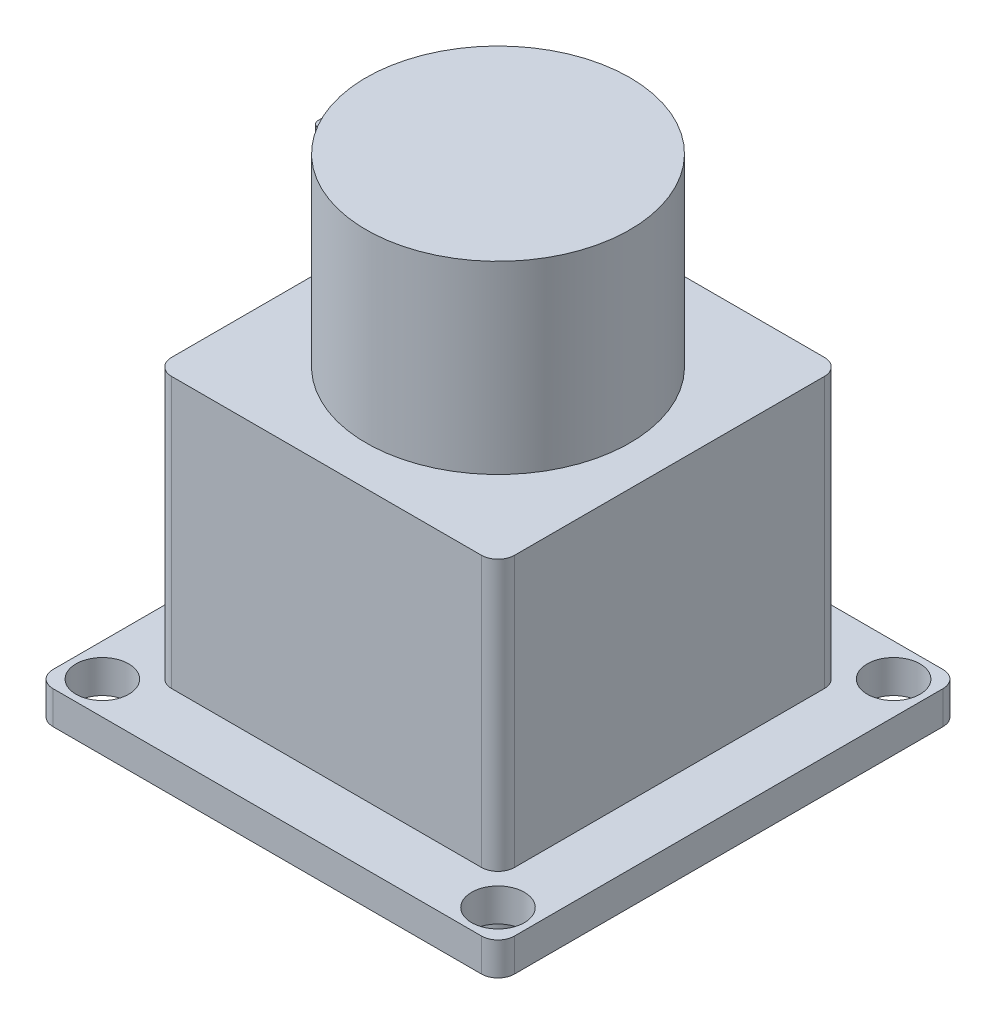
ISO-10303-21;
HEADER;
FILE_DESCRIPTION(('STEP AP214'),'2;1');
FILE_NAME('part.step','',(''),(''),'','','');
FILE_SCHEMA(('AUTOMOTIVE_DESIGN { 1 0 10303 214 1 1 1 1 }'));
ENDSEC;
DATA;
#1=APPLICATION_CONTEXT('core data for automotive mechanical design processes');
#2=APPLICATION_PROTOCOL_DEFINITION('international standard','automotive_design',2000,#1);
#3=PRODUCT_CONTEXT('',#1,'mechanical');
#4=PRODUCT('Part','Part','',(#3));
#5=PRODUCT_RELATED_PRODUCT_CATEGORY('part','',(#4));
#6=PRODUCT_DEFINITION_FORMATION('','',#4);
#7=PRODUCT_DEFINITION_CONTEXT('part definition',#1,'design');
#8=PRODUCT_DEFINITION('design','',#6,#7);
#9=PRODUCT_DEFINITION_SHAPE('','',#8);
#10=(LENGTH_UNIT() NAMED_UNIT(*) SI_UNIT(.MILLI.,.METRE.));
#11=(NAMED_UNIT(*) PLANE_ANGLE_UNIT() SI_UNIT($,.RADIAN.));
#12=(NAMED_UNIT(*) SI_UNIT($,.STERADIAN.) SOLID_ANGLE_UNIT());
#13=UNCERTAINTY_MEASURE_WITH_UNIT(LENGTH_MEASURE(1.E-05),#10,'distance_accuracy_value','');
#14=(GEOMETRIC_REPRESENTATION_CONTEXT(3) GLOBAL_UNCERTAINTY_ASSIGNED_CONTEXT((#13)) GLOBAL_UNIT_ASSIGNED_CONTEXT((#10,
#11,#12)) REPRESENTATION_CONTEXT('',''));
#15=CARTESIAN_POINT('',(0.,0.,0.));
#16=DIRECTION('',(0.,0.,1.));
#17=DIRECTION('',(1.,0.,0.));
#18=AXIS2_PLACEMENT_3D('',#15,#16,#17);
#19=CARTESIAN_POINT('',(0.,74.,0.));
#20=DIRECTION('',(0.,1.,0.));
#21=DIRECTION('',(0.,0.,1.));
#22=AXIS2_PLACEMENT_3D('',#19,#20,#21);
#23=PLANE('',#22);
#24=CARTESIAN_POINT('',(-1.07552855510562E-13,74.,0.));
#25=DIRECTION('',(0.,-1.,0.));
#26=DIRECTION('',(0.,0.,-1.));
#27=AXIS2_PLACEMENT_3D('',#24,#25,#26);
#28=CIRCLE('',#27,20.);
#29=CARTESIAN_POINT('',(-1.07552855510562E-13,74.,-20.));
#30=VERTEX_POINT('',#29);
#31=EDGE_CURVE('E20',#30,#30,#28,.T.);
#32=ORIENTED_EDGE('',*,*,#31,.F.);
#33=EDGE_LOOP('',(#32));
#34=FACE_BOUND('',#33,.T.);
#35=ADVANCED_FACE('F17',(#34),#23,.T.);
#36=CARTESIAN_POINT('',(-22.9365172470036,66.,-2.25));
#37=DIRECTION('',(0.,0.,-1.));
#38=DIRECTION('',(-1.,0.,0.));
#39=AXIS2_PLACEMENT_3D('',#36,#37,#38);
#40=PLANE('',#39);
#41=DIRECTION('',(1.,0.,0.));
#42=VECTOR('',#41,1.);
#43=CARTESIAN_POINT('',(0.,66.,-2.25));
#44=LINE('',#43,#42);
#45=CARTESIAN_POINT('',(-19.8730344940073,66.,-2.25));
#46=VERTEX_POINT('',#45);
#47=CARTESIAN_POINT('',(-25.,66.,-2.25));
#48=VERTEX_POINT('',#47);
#49=EDGE_CURVE('E183',#46,#48,#44,.F.);
#50=ORIENTED_EDGE('',*,*,#49,.F.);
#51=DIRECTION('',(0.,-1.,0.));
#52=VECTOR('',#51,1.);
#53=CARTESIAN_POINT('',(-19.8730344940073,74.,-2.24999999999999));
#54=LINE('',#53,#52);
#55=CARTESIAN_POINT('',(-19.8730344940073,46.,-2.25));
#56=VERTEX_POINT('',#55);
#57=EDGE_CURVE('E169',#56,#46,#54,.F.);
#58=ORIENTED_EDGE('',*,*,#57,.F.);
#59=DIRECTION('',(1.,0.,0.));
#60=VECTOR('',#59,1.);
#61=CARTESIAN_POINT('',(0.,46.,-2.25));
#62=LINE('',#61,#60);
#63=CARTESIAN_POINT('',(-25.,46.,-2.25));
#64=VERTEX_POINT('',#63);
#65=EDGE_CURVE('E311',#64,#56,#62,.T.);
#66=ORIENTED_EDGE('',*,*,#65,.F.);
#67=DIRECTION('',(0.,-1.,0.));
#68=VECTOR('',#67,1.);
#69=CARTESIAN_POINT('',(-25.,46.,-2.25));
#70=LINE('',#69,#68);
#71=EDGE_CURVE('E190',#48,#64,#70,.T.);
#72=ORIENTED_EDGE('',*,*,#71,.F.);
#73=EDGE_LOOP('',(#50,#58,#66,#72));
#74=FACE_BOUND('',#73,.T.);
#75=ADVANCED_FACE('F189',(#74),#40,.T.);
#76=CARTESIAN_POINT('',(-1.07552855510562E-13,74.,0.));
#77=DIRECTION('',(0.,-1.,0.));
#78=DIRECTION('',(0.,0.,-1.));
#79=AXIS2_PLACEMENT_3D('',#76,#77,#78);
#80=CYLINDRICAL_SURFACE('',#79,20.);
#81=CARTESIAN_POINT('',(-1.07552855510562E-13,46.,0.));
#82=DIRECTION('',(0.,-1.,0.));
#83=DIRECTION('',(0.,0.,-1.));
#84=AXIS2_PLACEMENT_3D('',#81,#82,#83);
#85=CIRCLE('',#84,20.);
#86=CARTESIAN_POINT('',(-19.8730344940073,46.,2.25));
#87=VERTEX_POINT('',#86);
#88=EDGE_CURVE('E174',#56,#87,#85,.T.);
#89=ORIENTED_EDGE('',*,*,#88,.F.);
#90=ORIENTED_EDGE('',*,*,#57,.T.);
#91=CARTESIAN_POINT('',(-1.07552855510562E-13,66.,0.));
#92=DIRECTION('',(0.,-1.,0.));
#93=DIRECTION('',(0.,0.,-1.));
#94=AXIS2_PLACEMENT_3D('',#91,#92,#93);
#95=CIRCLE('',#94,20.);
#96=CARTESIAN_POINT('',(-19.8730344940073,66.,2.25));
#97=VERTEX_POINT('',#96);
#98=EDGE_CURVE('E173',#97,#46,#95,.T.);
#99=ORIENTED_EDGE('',*,*,#98,.F.);
#100=DIRECTION('',(0.,1.,0.));
#101=VECTOR('',#100,1.);
#102=CARTESIAN_POINT('',(-19.8730344940073,66.,2.25));
#103=LINE('',#102,#101);
#104=EDGE_CURVE('E163',#97,#87,#103,.F.);
#105=ORIENTED_EDGE('',*,*,#104,.T.);
#106=EDGE_LOOP('',(#89,#90,#99,#105));
#107=FACE_BOUND('',#106,.T.);
#108=ORIENTED_EDGE('',*,*,#31,.T.);
#109=EDGE_LOOP('',(#108));
#110=FACE_BOUND('',#109,.T.);
#111=ADVANCED_FACE('F171',(#107,#110),#80,.T.);
#112=CARTESIAN_POINT('',(-22.9365172470036,66.,2.25));
#113=DIRECTION('',(0.,0.,-1.));
#114=DIRECTION('',(-1.,0.,0.));
#115=AXIS2_PLACEMENT_3D('',#112,#113,#114);
#116=PLANE('',#115);
#117=DIRECTION('',(0.,1.,0.));
#118=VECTOR('',#117,1.);
#119=CARTESIAN_POINT('',(-25.,66.,2.25));
#120=LINE('',#119,#118);
#121=CARTESIAN_POINT('',(-25.,46.,2.25));
#122=VERTEX_POINT('',#121);
#123=CARTESIAN_POINT('',(-25.,66.,2.25));
#124=VERTEX_POINT('',#123);
#125=EDGE_CURVE('E196',#122,#124,#120,.T.);
#126=ORIENTED_EDGE('',*,*,#125,.F.);
#127=DIRECTION('',(1.,0.,0.));
#128=VECTOR('',#127,1.);
#129=CARTESIAN_POINT('',(0.,46.,2.25));
#130=LINE('',#129,#128);
#131=EDGE_CURVE('E309',#87,#122,#130,.F.);
#132=ORIENTED_EDGE('',*,*,#131,.F.);
#133=ORIENTED_EDGE('',*,*,#104,.F.);
#134=DIRECTION('',(1.,0.,0.));
#135=VECTOR('',#134,1.);
#136=CARTESIAN_POINT('',(0.,66.,2.25));
#137=LINE('',#136,#135);
#138=EDGE_CURVE('E186',#124,#97,#137,.T.);
#139=ORIENTED_EDGE('',*,*,#138,.F.);
#140=EDGE_LOOP('',(#126,#132,#133,#139));
#141=FACE_BOUND('',#140,.T.);
#142=ADVANCED_FACE('F547',(#141),#116,.F.);
#143=CARTESIAN_POINT('',(0.,66.,0.));
#144=DIRECTION('',(0.,1.,0.));
#145=DIRECTION('',(0.,0.,1.));
#146=AXIS2_PLACEMENT_3D('',#143,#144,#145);
#147=PLANE('',#146);
#148=ORIENTED_EDGE('',*,*,#138,.T.);
#149=ORIENTED_EDGE('',*,*,#98,.T.);
#150=ORIENTED_EDGE('',*,*,#49,.T.);
#151=CARTESIAN_POINT('',(-25.,66.,-1.25));
#152=DIRECTION('',(0.,-1.,0.));
#153=DIRECTION('',(0.,0.,-1.));
#154=AXIS2_PLACEMENT_3D('',#151,#152,#153);
#155=CIRCLE('',#154,1.);
#156=CARTESIAN_POINT('',(-26.,66.,-1.25));
#157=VERTEX_POINT('',#156);
#158=EDGE_CURVE('E187',#157,#48,#155,.T.);
#159=ORIENTED_EDGE('',*,*,#158,.F.);
#160=DIRECTION('',(0.,0.,1.));
#161=VECTOR('',#160,1.);
#162=CARTESIAN_POINT('',(-26.,66.,0.));
#163=LINE('',#162,#161);
#164=CARTESIAN_POINT('',(-26.,66.,1.25));
#165=VERTEX_POINT('',#164);
#166=EDGE_CURVE('E321',#165,#157,#163,.F.);
#167=ORIENTED_EDGE('',*,*,#166,.F.);
#168=CARTESIAN_POINT('',(-25.,66.,1.25));
#169=DIRECTION('',(0.,1.,0.));
#170=DIRECTION('',(0.,0.,1.));
#171=AXIS2_PLACEMENT_3D('',#168,#169,#170);
#172=CIRCLE('',#171,1.);
#173=EDGE_CURVE('E199',#124,#165,#172,.F.);
#174=ORIENTED_EDGE('',*,*,#173,.F.);
#175=EDGE_LOOP('',(#148,#149,#150,#159,#167,#174));
#176=FACE_BOUND('',#175,.T.);
#177=ADVANCED_FACE('F181',(#176),#147,.T.);
#178=CARTESIAN_POINT('',(-25.,46.,-1.25));
#179=DIRECTION('',(0.,-1.,0.));
#180=DIRECTION('',(0.,0.,-1.));
#181=AXIS2_PLACEMENT_3D('',#178,#179,#180);
#182=CYLINDRICAL_SURFACE('',#181,1.);
#183=CARTESIAN_POINT('',(-25.,46.,-1.25));
#184=DIRECTION('',(0.,-1.,0.));
#185=DIRECTION('',(0.,0.,-1.));
#186=AXIS2_PLACEMENT_3D('',#183,#184,#185);
#187=CIRCLE('',#186,1.);
#188=CARTESIAN_POINT('',(-26.,46.,-1.25));
#189=VERTEX_POINT('',#188);
#190=EDGE_CURVE('E198',#189,#64,#187,.T.);
#191=ORIENTED_EDGE('',*,*,#190,.F.);
#192=DIRECTION('',(0.,1.,0.));
#193=VECTOR('',#192,1.);
#194=CARTESIAN_POINT('',(-26.,46.,-1.25));
#195=LINE('',#194,#193);
#196=EDGE_CURVE('E319',#157,#189,#195,.F.);
#197=ORIENTED_EDGE('',*,*,#196,.F.);
#198=ORIENTED_EDGE('',*,*,#158,.T.);
#199=ORIENTED_EDGE('',*,*,#71,.T.);
#200=EDGE_LOOP('',(#191,#197,#198,#199));
#201=FACE_BOUND('',#200,.T.);
#202=ADVANCED_FACE('F318',(#201),#182,.T.);
#203=CARTESIAN_POINT('',(-25.,66.,1.25));
#204=DIRECTION('',(0.,1.,0.));
#205=DIRECTION('',(0.,0.,1.));
#206=AXIS2_PLACEMENT_3D('',#203,#204,#205);
#207=CYLINDRICAL_SURFACE('',#206,1.);
#208=CARTESIAN_POINT('',(-25.,46.,1.25));
#209=DIRECTION('',(0.,1.,0.));
#210=DIRECTION('',(0.,0.,1.));
#211=AXIS2_PLACEMENT_3D('',#208,#209,#210);
#212=CIRCLE('',#211,1.);
#213=CARTESIAN_POINT('',(-26.,46.,1.25));
#214=VERTEX_POINT('',#213);
#215=EDGE_CURVE('E307',#122,#214,#212,.F.);
#216=ORIENTED_EDGE('',*,*,#215,.F.);
#217=ORIENTED_EDGE('',*,*,#125,.T.);
#218=ORIENTED_EDGE('',*,*,#173,.T.);
#219=DIRECTION('',(0.,1.,0.));
#220=VECTOR('',#219,1.);
#221=CARTESIAN_POINT('',(-26.,46.,1.25));
#222=LINE('',#221,#220);
#223=EDGE_CURVE('E302',#214,#165,#222,.T.);
#224=ORIENTED_EDGE('',*,*,#223,.F.);
#225=EDGE_LOOP('',(#216,#217,#218,#224));
#226=FACE_BOUND('',#225,.T.);
#227=ADVANCED_FACE('F538',(#226),#207,.T.);
#228=CARTESIAN_POINT('',(0.,46.,0.));
#229=DIRECTION('',(0.,1.,0.));
#230=DIRECTION('',(0.,0.,1.));
#231=AXIS2_PLACEMENT_3D('',#228,#229,#230);
#232=PLANE('',#231);
#233=DIRECTION('',(-1.,0.,0.));
#234=VECTOR('',#233,1.);
#235=CARTESIAN_POINT('',(0.,46.,-26.));
#236=LINE('',#235,#234);
#237=CARTESIAN_POINT('',(-23.5,46.,-26.));
#238=VERTEX_POINT('',#237);
#239=CARTESIAN_POINT('',(23.5,46.,-26.));
#240=VERTEX_POINT('',#239);
#241=EDGE_CURVE('E335',#238,#240,#236,.F.);
#242=ORIENTED_EDGE('',*,*,#241,.F.);
#243=CARTESIAN_POINT('',(-23.5,46.,-23.5));
#244=DIRECTION('',(0.,-1.,0.));
#245=DIRECTION('',(0.,0.,-1.));
#246=AXIS2_PLACEMENT_3D('',#243,#244,#245);
#247=CIRCLE('',#246,2.5);
#248=CARTESIAN_POINT('',(-26.,46.,-23.5));
#249=VERTEX_POINT('',#248);
#250=EDGE_CURVE('E299',#249,#238,#247,.T.);
#251=ORIENTED_EDGE('',*,*,#250,.F.);
#252=DIRECTION('',(0.,0.,1.));
#253=VECTOR('',#252,1.);
#254=CARTESIAN_POINT('',(-26.,46.,0.));
#255=LINE('',#254,#253);
#256=EDGE_CURVE('E324',#189,#249,#255,.F.);
#257=ORIENTED_EDGE('',*,*,#256,.F.);
#258=ORIENTED_EDGE('',*,*,#190,.T.);
#259=ORIENTED_EDGE('',*,*,#65,.T.);
#260=ORIENTED_EDGE('',*,*,#88,.T.);
#261=ORIENTED_EDGE('',*,*,#131,.T.);
#262=ORIENTED_EDGE('',*,*,#215,.T.);
#263=DIRECTION('',(0.,0.,1.));
#264=VECTOR('',#263,1.);
#265=CARTESIAN_POINT('',(-26.,46.,0.));
#266=LINE('',#265,#264);
#267=CARTESIAN_POINT('',(-26.,46.,23.5));
#268=VERTEX_POINT('',#267);
#269=EDGE_CURVE('E330',#268,#214,#266,.F.);
#270=ORIENTED_EDGE('',*,*,#269,.F.);
#271=CARTESIAN_POINT('',(-23.5,46.,23.5));
#272=DIRECTION('',(0.,1.,0.));
#273=DIRECTION('',(0.,0.,1.));
#274=AXIS2_PLACEMENT_3D('',#271,#272,#273);
#275=CIRCLE('',#274,2.5);
#276=CARTESIAN_POINT('',(-23.5,46.,26.));
#277=VERTEX_POINT('',#276);
#278=EDGE_CURVE('E303',#277,#268,#275,.F.);
#279=ORIENTED_EDGE('',*,*,#278,.F.);
#280=DIRECTION('',(-1.,0.,0.));
#281=VECTOR('',#280,1.);
#282=CARTESIAN_POINT('',(0.,46.,26.));
#283=LINE('',#282,#281);
#284=CARTESIAN_POINT('',(23.5,46.,26.));
#285=VERTEX_POINT('',#284);
#286=EDGE_CURVE('E306',#277,#285,#283,.F.);
#287=ORIENTED_EDGE('',*,*,#286,.T.);
#288=CARTESIAN_POINT('',(23.5,46.,23.5));
#289=DIRECTION('',(0.,-1.,0.));
#290=DIRECTION('',(0.,0.,-1.));
#291=AXIS2_PLACEMENT_3D('',#288,#289,#290);
#292=CIRCLE('',#291,2.5);
#293=CARTESIAN_POINT('',(26.,46.,23.5));
#294=VERTEX_POINT('',#293);
#295=EDGE_CURVE('E291',#294,#285,#292,.T.);
#296=ORIENTED_EDGE('',*,*,#295,.F.);
#297=DIRECTION('',(0.,0.,1.));
#298=VECTOR('',#297,1.);
#299=CARTESIAN_POINT('',(26.,46.,0.));
#300=LINE('',#299,#298);
#301=CARTESIAN_POINT('',(26.,46.,-23.5));
#302=VERTEX_POINT('',#301);
#303=EDGE_CURVE('E294',#294,#302,#300,.F.);
#304=ORIENTED_EDGE('',*,*,#303,.T.);
#305=CARTESIAN_POINT('',(23.5,46.,-23.5));
#306=DIRECTION('',(0.,1.,0.));
#307=DIRECTION('',(0.,0.,1.));
#308=AXIS2_PLACEMENT_3D('',#305,#306,#307);
#309=CIRCLE('',#308,2.5);
#310=EDGE_CURVE('E295',#240,#302,#309,.F.);
#311=ORIENTED_EDGE('',*,*,#310,.F.);
#312=EDGE_LOOP('',(#242,#251,#257,#258,#259,#260,#261,#262,#270,#279,#287,#296,#304,#311));
#313=FACE_BOUND('',#312,.T.);
#314=ADVANCED_FACE('F534',(#313),#232,.T.);
#315=CARTESIAN_POINT('',(0.,46.,26.));
#316=DIRECTION('',(0.,0.,-1.));
#317=DIRECTION('',(-1.,0.,0.));
#318=AXIS2_PLACEMENT_3D('',#315,#316,#317);
#319=PLANE('',#318);
#320=DIRECTION('',(0.,1.,0.));
#321=VECTOR('',#320,1.);
#322=CARTESIAN_POINT('',(-23.5,46.,26.));
#323=LINE('',#322,#321);
#324=CARTESIAN_POINT('',(-23.5,5.,26.));
#325=VERTEX_POINT('',#324);
#326=EDGE_CURVE('E305',#325,#277,#323,.T.);
#327=ORIENTED_EDGE('',*,*,#326,.F.);
#328=DIRECTION('',(1.,0.,0.));
#329=VECTOR('',#328,1.);
#330=CARTESIAN_POINT('',(0.,5.,26.));
#331=LINE('',#330,#329);
#332=CARTESIAN_POINT('',(23.5,5.,26.));
#333=VERTEX_POINT('',#332);
#334=EDGE_CURVE('E290',#333,#325,#331,.F.);
#335=ORIENTED_EDGE('',*,*,#334,.F.);
#336=DIRECTION('',(0.,-1.,0.));
#337=VECTOR('',#336,1.);
#338=CARTESIAN_POINT('',(23.5,46.,26.));
#339=LINE('',#338,#337);
#340=EDGE_CURVE('E293',#285,#333,#339,.T.);
#341=ORIENTED_EDGE('',*,*,#340,.F.);
#342=ORIENTED_EDGE('',*,*,#286,.F.);
#343=EDGE_LOOP('',(#327,#335,#341,#342));
#344=FACE_BOUND('',#343,.T.);
#345=ADVANCED_FACE('F530',(#344),#319,.F.);
#346=CARTESIAN_POINT('',(-23.5,46.,23.5));
#347=DIRECTION('',(0.,1.,0.));
#348=DIRECTION('',(0.,0.,1.));
#349=AXIS2_PLACEMENT_3D('',#346,#347,#348);
#350=CYLINDRICAL_SURFACE('',#349,2.5);
#351=CARTESIAN_POINT('',(-23.5,5.,23.5));
#352=DIRECTION('',(0.,1.,0.));
#353=DIRECTION('',(0.,0.,1.));
#354=AXIS2_PLACEMENT_3D('',#351,#352,#353);
#355=CIRCLE('',#354,2.5);
#356=CARTESIAN_POINT('',(-26.,5.,23.5));
#357=VERTEX_POINT('',#356);
#358=EDGE_CURVE('E288',#325,#357,#355,.F.);
#359=ORIENTED_EDGE('',*,*,#358,.F.);
#360=ORIENTED_EDGE('',*,*,#326,.T.);
#361=ORIENTED_EDGE('',*,*,#278,.T.);
#362=DIRECTION('',(0.,1.,0.));
#363=VECTOR('',#362,1.);
#364=CARTESIAN_POINT('',(-26.,46.,23.5));
#365=LINE('',#364,#363);
#366=EDGE_CURVE('E333',#357,#268,#365,.T.);
#367=ORIENTED_EDGE('',*,*,#366,.F.);
#368=EDGE_LOOP('',(#359,#360,#361,#367));
#369=FACE_BOUND('',#368,.T.);
#370=ADVANCED_FACE('F527',(#369),#350,.T.);
#371=CARTESIAN_POINT('',(-26.,46.,0.));
#372=DIRECTION('',(-1.,0.,0.));
#373=DIRECTION('',(0.,0.,1.));
#374=AXIS2_PLACEMENT_3D('',#371,#372,#373);
#375=PLANE('',#374);
#376=ORIENTED_EDGE('',*,*,#269,.T.);
#377=ORIENTED_EDGE('',*,*,#223,.T.);
#378=ORIENTED_EDGE('',*,*,#166,.T.);
#379=ORIENTED_EDGE('',*,*,#196,.T.);
#380=ORIENTED_EDGE('',*,*,#256,.T.);
#381=DIRECTION('',(0.,-1.,0.));
#382=VECTOR('',#381,1.);
#383=CARTESIAN_POINT('',(-26.,46.,-23.5));
#384=LINE('',#383,#382);
#385=CARTESIAN_POINT('',(-26.,5.,-23.5));
#386=VERTEX_POINT('',#385);
#387=EDGE_CURVE('E301',#386,#249,#384,.F.);
#388=ORIENTED_EDGE('',*,*,#387,.F.);
#389=DIRECTION('',(0.,0.,1.));
#390=VECTOR('',#389,1.);
#391=CARTESIAN_POINT('',(-26.,5.,0.));
#392=LINE('',#391,#390);
#393=EDGE_CURVE('E287',#357,#386,#392,.F.);
#394=ORIENTED_EDGE('',*,*,#393,.F.);
#395=ORIENTED_EDGE('',*,*,#366,.T.);
#396=EDGE_LOOP('',(#376,#377,#378,#379,#380,#388,#394,#395));
#397=FACE_BOUND('',#396,.T.);
#398=ADVANCED_FACE('F523',(#397),#375,.T.);
#399=CARTESIAN_POINT('',(-23.5,46.,-23.5));
#400=DIRECTION('',(0.,-1.,0.));
#401=DIRECTION('',(0.,0.,-1.));
#402=AXIS2_PLACEMENT_3D('',#399,#400,#401);
#403=CYLINDRICAL_SURFACE('',#402,2.5);
#404=CARTESIAN_POINT('',(-23.5,5.,-23.5));
#405=DIRECTION('',(0.,-1.,0.));
#406=DIRECTION('',(0.,0.,-1.));
#407=AXIS2_PLACEMENT_3D('',#404,#405,#406);
#408=CIRCLE('',#407,2.5);
#409=CARTESIAN_POINT('',(-23.5,5.,-26.));
#410=VERTEX_POINT('',#409);
#411=EDGE_CURVE('E285',#386,#410,#408,.T.);
#412=ORIENTED_EDGE('',*,*,#411,.F.);
#413=ORIENTED_EDGE('',*,*,#387,.T.);
#414=ORIENTED_EDGE('',*,*,#250,.T.);
#415=DIRECTION('',(0.,1.,0.));
#416=VECTOR('',#415,1.);
#417=CARTESIAN_POINT('',(-23.5,46.,-26.));
#418=LINE('',#417,#416);
#419=EDGE_CURVE('E298',#410,#238,#418,.T.);
#420=ORIENTED_EDGE('',*,*,#419,.F.);
#421=EDGE_LOOP('',(#412,#413,#414,#420));
#422=FACE_BOUND('',#421,.T.);
#423=ADVANCED_FACE('F519',(#422),#403,.T.);
#424=CARTESIAN_POINT('',(0.,46.,-26.));
#425=DIRECTION('',(0.,0.,-1.));
#426=DIRECTION('',(-1.,0.,0.));
#427=AXIS2_PLACEMENT_3D('',#424,#425,#426);
#428=PLANE('',#427);
#429=DIRECTION('',(1.,0.,0.));
#430=VECTOR('',#429,1.);
#431=CARTESIAN_POINT('',(0.,5.,-26.));
#432=LINE('',#431,#430);
#433=CARTESIAN_POINT('',(23.5,5.,-26.));
#434=VERTEX_POINT('',#433);
#435=EDGE_CURVE('E284',#410,#434,#432,.T.);
#436=ORIENTED_EDGE('',*,*,#435,.F.);
#437=ORIENTED_EDGE('',*,*,#419,.T.);
#438=ORIENTED_EDGE('',*,*,#241,.T.);
#439=DIRECTION('',(0.,1.,0.));
#440=VECTOR('',#439,1.);
#441=CARTESIAN_POINT('',(23.5,46.,-26.));
#442=LINE('',#441,#440);
#443=EDGE_CURVE('E297',#434,#240,#442,.T.);
#444=ORIENTED_EDGE('',*,*,#443,.F.);
#445=EDGE_LOOP('',(#436,#437,#438,#444));
#446=FACE_BOUND('',#445,.T.);
#447=ADVANCED_FACE('F515',(#446),#428,.T.);
#448=CARTESIAN_POINT('',(23.5,46.,-23.5));
#449=DIRECTION('',(0.,1.,0.));
#450=DIRECTION('',(0.,0.,1.));
#451=AXIS2_PLACEMENT_3D('',#448,#449,#450);
#452=CYLINDRICAL_SURFACE('',#451,2.5);
#453=CARTESIAN_POINT('',(23.5,5.,-23.5));
#454=DIRECTION('',(0.,1.,0.));
#455=DIRECTION('',(0.,0.,1.));
#456=AXIS2_PLACEMENT_3D('',#453,#454,#455);
#457=CIRCLE('',#456,2.5);
#458=CARTESIAN_POINT('',(26.,5.,-23.5));
#459=VERTEX_POINT('',#458);
#460=EDGE_CURVE('E282',#434,#459,#457,.F.);
#461=ORIENTED_EDGE('',*,*,#460,.F.);
#462=ORIENTED_EDGE('',*,*,#443,.T.);
#463=ORIENTED_EDGE('',*,*,#310,.T.);
#464=DIRECTION('',(0.,1.,0.));
#465=VECTOR('',#464,1.);
#466=CARTESIAN_POINT('',(26.,46.,-23.5));
#467=LINE('',#466,#465);
#468=EDGE_CURVE('E342',#302,#459,#467,.F.);
#469=ORIENTED_EDGE('',*,*,#468,.T.);
#470=EDGE_LOOP('',(#461,#462,#463,#469));
#471=FACE_BOUND('',#470,.T.);
#472=ADVANCED_FACE('F511',(#471),#452,.T.);
#473=CARTESIAN_POINT('',(26.,46.,0.));
#474=DIRECTION('',(-1.,0.,0.));
#475=DIRECTION('',(0.,0.,1.));
#476=AXIS2_PLACEMENT_3D('',#473,#474,#475);
#477=PLANE('',#476);
#478=DIRECTION('',(0.,-1.,0.));
#479=VECTOR('',#478,1.);
#480=CARTESIAN_POINT('',(26.,46.,23.5));
#481=LINE('',#480,#479);
#482=CARTESIAN_POINT('',(26.,5.,23.5));
#483=VERTEX_POINT('',#482);
#484=EDGE_CURVE('E354',#483,#294,#481,.F.);
#485=ORIENTED_EDGE('',*,*,#484,.F.);
#486=DIRECTION('',(0.,0.,1.));
#487=VECTOR('',#486,1.);
#488=CARTESIAN_POINT('',(26.,5.,0.));
#489=LINE('',#488,#487);
#490=EDGE_CURVE('E281',#459,#483,#489,.T.);
#491=ORIENTED_EDGE('',*,*,#490,.F.);
#492=ORIENTED_EDGE('',*,*,#468,.F.);
#493=ORIENTED_EDGE('',*,*,#303,.F.);
#494=EDGE_LOOP('',(#485,#491,#492,#493));
#495=FACE_BOUND('',#494,.T.);
#496=ADVANCED_FACE('F507',(#495),#477,.F.);
#497=CARTESIAN_POINT('',(23.5,46.,23.5));
#498=DIRECTION('',(0.,-1.,0.));
#499=DIRECTION('',(0.,0.,-1.));
#500=AXIS2_PLACEMENT_3D('',#497,#498,#499);
#501=CYLINDRICAL_SURFACE('',#500,2.5);
#502=CARTESIAN_POINT('',(23.5,5.,23.5));
#503=DIRECTION('',(0.,-1.,0.));
#504=DIRECTION('',(0.,0.,-1.));
#505=AXIS2_PLACEMENT_3D('',#502,#503,#504);
#506=CIRCLE('',#505,2.5);
#507=EDGE_CURVE('E278',#483,#333,#506,.T.);
#508=ORIENTED_EDGE('',*,*,#507,.F.);
#509=ORIENTED_EDGE('',*,*,#484,.T.);
#510=ORIENTED_EDGE('',*,*,#295,.T.);
#511=ORIENTED_EDGE('',*,*,#340,.T.);
#512=EDGE_LOOP('',(#508,#509,#510,#511));
#513=FACE_BOUND('',#512,.T.);
#514=ADVANCED_FACE('F503',(#513),#501,.T.);
#515=CARTESIAN_POINT('',(0.,-5.,0.));
#516=DIRECTION('',(0.,-1.,0.));
#517=DIRECTION('',(0.,0.,-1.));
#518=AXIS2_PLACEMENT_3D('',#515,#516,#517);
#519=PLANE('',#518);
#520=CARTESIAN_POINT('',(-21.,-5.,21.));
#521=DIRECTION('',(0.,1.,0.));
#522=DIRECTION('',(0.,0.,1.));
#523=AXIS2_PLACEMENT_3D('',#520,#521,#522);
#524=CIRCLE('',#523,4.);
#525=CARTESIAN_POINT('',(-21.,-5.,25.));
#526=VERTEX_POINT('',#525);
#527=EDGE_CURVE('E275',#526,#526,#524,.T.);
#528=ORIENTED_EDGE('',*,*,#527,.F.);
#529=EDGE_LOOP('',(#528));
#530=FACE_BOUND('',#529,.T.);
#531=ADVANCED_FACE('F499',(#530),#519,.T.);
#532=CARTESIAN_POINT('',(0.,-5.,0.));
#533=DIRECTION('',(0.,-1.,0.));
#534=DIRECTION('',(0.,0.,-1.));
#535=AXIS2_PLACEMENT_3D('',#532,#533,#534);
#536=PLANE('',#535);
#537=CARTESIAN_POINT('',(-21.,-5.,-21.));
#538=DIRECTION('',(0.,1.,0.));
#539=DIRECTION('',(0.,0.,1.));
#540=AXIS2_PLACEMENT_3D('',#537,#538,#539);
#541=CIRCLE('',#540,4.);
#542=CARTESIAN_POINT('',(-21.,-5.,-17.));
#543=VERTEX_POINT('',#542);
#544=EDGE_CURVE('E272',#543,#543,#541,.T.);
#545=ORIENTED_EDGE('',*,*,#544,.F.);
#546=EDGE_LOOP('',(#545));
#547=FACE_BOUND('',#546,.T.);
#548=ADVANCED_FACE('F495',(#547),#536,.T.);
#549=CARTESIAN_POINT('',(0.,-5.,0.));
#550=DIRECTION('',(0.,-1.,0.));
#551=DIRECTION('',(0.,0.,-1.));
#552=AXIS2_PLACEMENT_3D('',#549,#550,#551);
#553=PLANE('',#552);
#554=CARTESIAN_POINT('',(21.,-5.,-21.));
#555=DIRECTION('',(0.,1.,0.));
#556=DIRECTION('',(0.,0.,1.));
#557=AXIS2_PLACEMENT_3D('',#554,#555,#556);
#558=CIRCLE('',#557,4.);
#559=CARTESIAN_POINT('',(21.,-5.,-17.));
#560=VERTEX_POINT('',#559);
#561=EDGE_CURVE('E269',#560,#560,#558,.T.);
#562=ORIENTED_EDGE('',*,*,#561,.F.);
#563=EDGE_LOOP('',(#562));
#564=FACE_BOUND('',#563,.T.);
#565=ADVANCED_FACE('F491',(#564),#553,.T.);
#566=CARTESIAN_POINT('',(0.,-5.,0.));
#567=DIRECTION('',(0.,-1.,0.));
#568=DIRECTION('',(0.,0.,-1.));
#569=AXIS2_PLACEMENT_3D('',#566,#567,#568);
#570=PLANE('',#569);
#571=CARTESIAN_POINT('',(21.,-5.,21.));
#572=DIRECTION('',(0.,1.,0.));
#573=DIRECTION('',(0.,0.,1.));
#574=AXIS2_PLACEMENT_3D('',#571,#572,#573);
#575=CIRCLE('',#574,4.);
#576=CARTESIAN_POINT('',(21.,-5.,25.));
#577=VERTEX_POINT('',#576);
#578=EDGE_CURVE('E266',#577,#577,#575,.T.);
#579=ORIENTED_EDGE('',*,*,#578,.F.);
#580=EDGE_LOOP('',(#579));
#581=FACE_BOUND('',#580,.T.);
#582=ADVANCED_FACE('F428',(#581),#570,.T.);
#583=CARTESIAN_POINT('',(0.,5.,0.));
#584=DIRECTION('',(0.,1.,0.));
#585=DIRECTION('',(0.,0.,1.));
#586=AXIS2_PLACEMENT_3D('',#583,#584,#585);
#587=PLANE('',#586);
#588=ORIENTED_EDGE('',*,*,#490,.T.);
#589=ORIENTED_EDGE('',*,*,#507,.T.);
#590=ORIENTED_EDGE('',*,*,#334,.T.);
#591=ORIENTED_EDGE('',*,*,#358,.T.);
#592=ORIENTED_EDGE('',*,*,#393,.T.);
#593=ORIENTED_EDGE('',*,*,#411,.T.);
#594=ORIENTED_EDGE('',*,*,#435,.T.);
#595=ORIENTED_EDGE('',*,*,#460,.T.);
#596=EDGE_LOOP('',(#588,#589,#590,#591,#592,#593,#594,#595));
#597=FACE_BOUND('',#596,.T.);
#598=CARTESIAN_POINT('',(-30.,5.,30.));
#599=DIRECTION('',(0.,-1.,0.));
#600=DIRECTION('',(0.,0.,-1.));
#601=AXIS2_PLACEMENT_3D('',#598,#599,#600);
#602=CIRCLE('',#601,4.);
#603=CARTESIAN_POINT('',(-30.,5.,26.));
#604=VERTEX_POINT('',#603);
#605=EDGE_CURVE('E263',#604,#604,#602,.T.);
#606=ORIENTED_EDGE('',*,*,#605,.T.);
#607=EDGE_LOOP('',(#606));
#608=FACE_BOUND('',#607,.T.);
#609=CARTESIAN_POINT('',(30.,5.,30.));
#610=DIRECTION('',(0.,-1.,0.));
#611=DIRECTION('',(0.,0.,-1.));
#612=AXIS2_PLACEMENT_3D('',#609,#610,#611);
#613=CIRCLE('',#612,4.);
#614=CARTESIAN_POINT('',(30.,5.,26.));
#615=VERTEX_POINT('',#614);
#616=EDGE_CURVE('E260',#615,#615,#613,.T.);
#617=ORIENTED_EDGE('',*,*,#616,.T.);
#618=EDGE_LOOP('',(#617));
#619=FACE_BOUND('',#618,.T.);
#620=DIRECTION('',(-1.,0.,0.));
#621=VECTOR('',#620,1.);
#622=CARTESIAN_POINT('',(0.,5.,35.));
#623=LINE('',#622,#621);
#624=CARTESIAN_POINT('',(-32.5,5.,35.));
#625=VERTEX_POINT('',#624);
#626=CARTESIAN_POINT('',(32.5,5.,35.));
#627=VERTEX_POINT('',#626);
#628=EDGE_CURVE('E252',#625,#627,#623,.F.);
#629=ORIENTED_EDGE('',*,*,#628,.T.);
#630=CARTESIAN_POINT('',(32.5,5.,32.5));
#631=DIRECTION('',(0.,1.,0.));
#632=DIRECTION('',(0.,0.,1.));
#633=AXIS2_PLACEMENT_3D('',#630,#631,#632);
#634=CIRCLE('',#633,2.5);
#635=CARTESIAN_POINT('',(35.,5.,32.5));
#636=VERTEX_POINT('',#635);
#637=EDGE_CURVE('E249',#636,#627,#634,.F.);
#638=ORIENTED_EDGE('',*,*,#637,.F.);
#639=DIRECTION('',(0.,0.,-1.));
#640=VECTOR('',#639,1.);
#641=CARTESIAN_POINT('',(35.,5.,30.5));
#642=LINE('',#641,#640);
#643=CARTESIAN_POINT('',(35.,5.,-32.5));
#644=VERTEX_POINT('',#643);
#645=EDGE_CURVE('E363',#644,#636,#642,.F.);
#646=ORIENTED_EDGE('',*,*,#645,.F.);
#647=CARTESIAN_POINT('',(32.5,5.,-32.5));
#648=DIRECTION('',(0.,-1.,0.));
#649=DIRECTION('',(0.,0.,-1.));
#650=AXIS2_PLACEMENT_3D('',#647,#648,#649);
#651=CIRCLE('',#650,2.5);
#652=CARTESIAN_POINT('',(32.5,5.,-35.));
#653=VERTEX_POINT('',#652);
#654=EDGE_CURVE('E245',#653,#644,#651,.T.);
#655=ORIENTED_EDGE('',*,*,#654,.F.);
#656=DIRECTION('',(-1.,0.,0.));
#657=VECTOR('',#656,1.);
#658=CARTESIAN_POINT('',(0.,5.,-35.));
#659=LINE('',#658,#657);
#660=CARTESIAN_POINT('',(-32.5,5.,-35.));
#661=VERTEX_POINT('',#660);
#662=EDGE_CURVE('E365',#661,#653,#659,.F.);
#663=ORIENTED_EDGE('',*,*,#662,.F.);
#664=CARTESIAN_POINT('',(-32.5,5.,-32.5));
#665=DIRECTION('',(0.,1.,0.));
#666=DIRECTION('',(0.,0.,1.));
#667=AXIS2_PLACEMENT_3D('',#664,#665,#666);
#668=CIRCLE('',#667,2.5);
#669=CARTESIAN_POINT('',(-35.,5.,-32.5));
#670=VERTEX_POINT('',#669);
#671=EDGE_CURVE('E257',#670,#661,#668,.F.);
#672=ORIENTED_EDGE('',*,*,#671,.F.);
#673=DIRECTION('',(0.,0.,-1.));
#674=VECTOR('',#673,1.);
#675=CARTESIAN_POINT('',(-35.,5.,-2.5));
#676=LINE('',#675,#674);
#677=CARTESIAN_POINT('',(-35.,5.,32.5));
#678=VERTEX_POINT('',#677);
#679=EDGE_CURVE('E256',#670,#678,#676,.F.);
#680=ORIENTED_EDGE('',*,*,#679,.T.);
#681=CARTESIAN_POINT('',(-32.5,5.,32.5));
#682=DIRECTION('',(0.,-1.,0.));
#683=DIRECTION('',(0.,0.,-1.));
#684=AXIS2_PLACEMENT_3D('',#681,#682,#683);
#685=CIRCLE('',#684,2.5);
#686=EDGE_CURVE('E253',#625,#678,#685,.T.);
#687=ORIENTED_EDGE('',*,*,#686,.F.);
#688=EDGE_LOOP('',(#629,#638,#646,#655,#663,#672,#680,#687));
#689=FACE_BOUND('',#688,.T.);
#690=CARTESIAN_POINT('',(-30.,5.,-30.));
#691=DIRECTION('',(0.,-1.,0.));
#692=DIRECTION('',(0.,0.,-1.));
#693=AXIS2_PLACEMENT_3D('',#690,#691,#692);
#694=CIRCLE('',#693,4.);
#695=CARTESIAN_POINT('',(-30.,5.,-34.));
#696=VERTEX_POINT('',#695);
#697=EDGE_CURVE('E241',#696,#696,#694,.T.);
#698=ORIENTED_EDGE('',*,*,#697,.T.);
#699=EDGE_LOOP('',(#698));
#700=FACE_BOUND('',#699,.T.);
#701=CARTESIAN_POINT('',(30.,5.,-30.));
#702=DIRECTION('',(0.,-1.,0.));
#703=DIRECTION('',(0.,0.,-1.));
#704=AXIS2_PLACEMENT_3D('',#701,#702,#703);
#705=CIRCLE('',#704,4.);
#706=CARTESIAN_POINT('',(30.,5.,-34.));
#707=VERTEX_POINT('',#706);
#708=EDGE_CURVE('E238',#707,#707,#705,.T.);
#709=ORIENTED_EDGE('',*,*,#708,.T.);
#710=EDGE_LOOP('',(#709));
#711=FACE_BOUND('',#710,.T.);
#712=ADVANCED_FACE('F424',(#597,#608,#619,#689,#700,#711),#587,.T.);
#713=CARTESIAN_POINT('',(-21.,-5.,21.));
#714=DIRECTION('',(0.,1.,0.));
#715=DIRECTION('',(0.,0.,1.));
#716=AXIS2_PLACEMENT_3D('',#713,#714,#715);
#717=CYLINDRICAL_SURFACE('',#716,4.);
#718=CARTESIAN_POINT('',(-21.,0.,21.));
#719=DIRECTION('',(0.,1.,0.));
#720=DIRECTION('',(0.,0.,1.));
#721=AXIS2_PLACEMENT_3D('',#718,#719,#720);
#722=CIRCLE('',#721,4.);
#723=CARTESIAN_POINT('',(-21.,0.,25.));
#724=VERTEX_POINT('',#723);
#725=EDGE_CURVE('E235',#724,#724,#722,.F.);
#726=ORIENTED_EDGE('',*,*,#725,.T.);
#727=EDGE_LOOP('',(#726));
#728=FACE_BOUND('',#727,.T.);
#729=ORIENTED_EDGE('',*,*,#527,.T.);
#730=EDGE_LOOP('',(#729));
#731=FACE_BOUND('',#730,.T.);
#732=ADVANCED_FACE('F427',(#728,#731),#717,.T.);
#733=CARTESIAN_POINT('',(-21.,-5.,-21.));
#734=DIRECTION('',(0.,1.,0.));
#735=DIRECTION('',(0.,0.,1.));
#736=AXIS2_PLACEMENT_3D('',#733,#734,#735);
#737=CYLINDRICAL_SURFACE('',#736,4.);
#738=CARTESIAN_POINT('',(-21.,0.,-21.));
#739=DIRECTION('',(0.,1.,0.));
#740=DIRECTION('',(0.,0.,1.));
#741=AXIS2_PLACEMENT_3D('',#738,#739,#740);
#742=CIRCLE('',#741,4.);
#743=CARTESIAN_POINT('',(-21.,0.,-17.));
#744=VERTEX_POINT('',#743);
#745=EDGE_CURVE('E232',#744,#744,#742,.F.);
#746=ORIENTED_EDGE('',*,*,#745,.T.);
#747=EDGE_LOOP('',(#746));
#748=FACE_BOUND('',#747,.T.);
#749=ORIENTED_EDGE('',*,*,#544,.T.);
#750=EDGE_LOOP('',(#749));
#751=FACE_BOUND('',#750,.T.);
#752=ADVANCED_FACE('F481',(#748,#751),#737,.T.);
#753=CARTESIAN_POINT('',(21.,-5.,-21.));
#754=DIRECTION('',(0.,1.,0.));
#755=DIRECTION('',(0.,0.,1.));
#756=AXIS2_PLACEMENT_3D('',#753,#754,#755);
#757=CYLINDRICAL_SURFACE('',#756,4.);
#758=CARTESIAN_POINT('',(21.,0.,-21.));
#759=DIRECTION('',(0.,1.,0.));
#760=DIRECTION('',(0.,0.,1.));
#761=AXIS2_PLACEMENT_3D('',#758,#759,#760);
#762=CIRCLE('',#761,4.);
#763=CARTESIAN_POINT('',(21.,0.,-17.));
#764=VERTEX_POINT('',#763);
#765=EDGE_CURVE('E229',#764,#764,#762,.F.);
#766=ORIENTED_EDGE('',*,*,#765,.T.);
#767=EDGE_LOOP('',(#766));
#768=FACE_BOUND('',#767,.T.);
#769=ORIENTED_EDGE('',*,*,#561,.T.);
#770=EDGE_LOOP('',(#769));
#771=FACE_BOUND('',#770,.T.);
#772=ADVANCED_FACE('F477',(#768,#771),#757,.T.);
#773=CARTESIAN_POINT('',(21.,-5.,21.));
#774=DIRECTION('',(0.,1.,0.));
#775=DIRECTION('',(0.,0.,1.));
#776=AXIS2_PLACEMENT_3D('',#773,#774,#775);
#777=CYLINDRICAL_SURFACE('',#776,4.);
#778=ORIENTED_EDGE('',*,*,#578,.T.);
#779=EDGE_LOOP('',(#778));
#780=FACE_BOUND('',#779,.T.);
#781=CARTESIAN_POINT('',(21.,0.,21.));
#782=DIRECTION('',(0.,1.,0.));
#783=DIRECTION('',(0.,0.,1.));
#784=AXIS2_PLACEMENT_3D('',#781,#782,#783);
#785=CIRCLE('',#784,4.);
#786=CARTESIAN_POINT('',(21.,0.,25.));
#787=VERTEX_POINT('',#786);
#788=EDGE_CURVE('E226',#787,#787,#785,.F.);
#789=ORIENTED_EDGE('',*,*,#788,.T.);
#790=EDGE_LOOP('',(#789));
#791=FACE_BOUND('',#790,.T.);
#792=ADVANCED_FACE('F473',(#780,#791),#777,.T.);
#793=CARTESIAN_POINT('',(-30.,5.,30.));
#794=DIRECTION('',(0.,-1.,0.));
#795=DIRECTION('',(0.,0.,-1.));
#796=AXIS2_PLACEMENT_3D('',#793,#794,#795);
#797=CYLINDRICAL_SURFACE('',#796,4.);
#798=CARTESIAN_POINT('',(-30.,0.,30.));
#799=DIRECTION('',(0.,-1.,0.));
#800=DIRECTION('',(0.,0.,-1.));
#801=AXIS2_PLACEMENT_3D('',#798,#799,#800);
#802=CIRCLE('',#801,4.);
#803=CARTESIAN_POINT('',(-30.,0.,26.));
#804=VERTEX_POINT('',#803);
#805=EDGE_CURVE('E223',#804,#804,#802,.T.);
#806=ORIENTED_EDGE('',*,*,#805,.T.);
#807=EDGE_LOOP('',(#806));
#808=FACE_BOUND('',#807,.T.);
#809=ORIENTED_EDGE('',*,*,#605,.F.);
#810=EDGE_LOOP('',(#809));
#811=FACE_BOUND('',#810,.T.);
#812=ADVANCED_FACE('F469',(#808,#811),#797,.F.);
#813=CARTESIAN_POINT('',(30.,5.,30.));
#814=DIRECTION('',(0.,-1.,0.));
#815=DIRECTION('',(0.,0.,-1.));
#816=AXIS2_PLACEMENT_3D('',#813,#814,#815);
#817=CYLINDRICAL_SURFACE('',#816,4.);
#818=CARTESIAN_POINT('',(30.,0.,30.));
#819=DIRECTION('',(0.,-1.,0.));
#820=DIRECTION('',(0.,0.,-1.));
#821=AXIS2_PLACEMENT_3D('',#818,#819,#820);
#822=CIRCLE('',#821,4.);
#823=CARTESIAN_POINT('',(30.,0.,26.));
#824=VERTEX_POINT('',#823);
#825=EDGE_CURVE('E220',#824,#824,#822,.T.);
#826=ORIENTED_EDGE('',*,*,#825,.T.);
#827=EDGE_LOOP('',(#826));
#828=FACE_BOUND('',#827,.T.);
#829=ORIENTED_EDGE('',*,*,#616,.F.);
#830=EDGE_LOOP('',(#829));
#831=FACE_BOUND('',#830,.T.);
#832=ADVANCED_FACE('F466',(#828,#831),#817,.F.);
#833=CARTESIAN_POINT('',(-32.5,5.,-32.5));
#834=DIRECTION('',(0.,1.,0.));
#835=DIRECTION('',(0.,0.,1.));
#836=AXIS2_PLACEMENT_3D('',#833,#834,#835);
#837=CYLINDRICAL_SURFACE('',#836,2.5);
#838=CARTESIAN_POINT('',(-32.5,0.,-32.5));
#839=DIRECTION('',(0.,1.,0.));
#840=DIRECTION('',(0.,0.,1.));
#841=AXIS2_PLACEMENT_3D('',#838,#839,#840);
#842=CIRCLE('',#841,2.5);
#843=CARTESIAN_POINT('',(-32.5,0.,-35.));
#844=VERTEX_POINT('',#843);
#845=CARTESIAN_POINT('',(-35.,0.,-32.5));
#846=VERTEX_POINT('',#845);
#847=EDGE_CURVE('E217',#844,#846,#842,.T.);
#848=ORIENTED_EDGE('',*,*,#847,.T.);
#849=DIRECTION('',(0.,1.,0.));
#850=VECTOR('',#849,1.);
#851=CARTESIAN_POINT('',(-35.,5.,-32.5));
#852=LINE('',#851,#850);
#853=EDGE_CURVE('E259',#846,#670,#852,.T.);
#854=ORIENTED_EDGE('',*,*,#853,.T.);
#855=ORIENTED_EDGE('',*,*,#671,.T.);
#856=DIRECTION('',(0.,1.,0.));
#857=VECTOR('',#856,1.);
#858=CARTESIAN_POINT('',(-32.5,5.,-35.));
#859=LINE('',#858,#857);
#860=EDGE_CURVE('E244',#844,#661,#859,.T.);
#861=ORIENTED_EDGE('',*,*,#860,.F.);
#862=EDGE_LOOP('',(#848,#854,#855,#861));
#863=FACE_BOUND('',#862,.T.);
#864=ADVANCED_FACE('F422',(#863),#837,.T.);
#865=CARTESIAN_POINT('',(-35.,5.,-2.5));
#866=DIRECTION('',(1.,0.,0.));
#867=DIRECTION('',(0.,0.,-1.));
#868=AXIS2_PLACEMENT_3D('',#865,#866,#867);
#869=PLANE('',#868);
#870=ORIENTED_EDGE('',*,*,#853,.F.);
#871=DIRECTION('',(0.,0.,1.));
#872=VECTOR('',#871,1.);
#873=CARTESIAN_POINT('',(-35.,0.,0.));
#874=LINE('',#873,#872);
#875=CARTESIAN_POINT('',(-35.,0.,32.5));
#876=VERTEX_POINT('',#875);
#877=EDGE_CURVE('E216',#846,#876,#874,.T.);
#878=ORIENTED_EDGE('',*,*,#877,.T.);
#879=DIRECTION('',(0.,-1.,0.));
#880=VECTOR('',#879,1.);
#881=CARTESIAN_POINT('',(-35.,5.,32.5));
#882=LINE('',#881,#880);
#883=EDGE_CURVE('E255',#678,#876,#882,.T.);
#884=ORIENTED_EDGE('',*,*,#883,.F.);
#885=ORIENTED_EDGE('',*,*,#679,.F.);
#886=EDGE_LOOP('',(#870,#878,#884,#885));
#887=FACE_BOUND('',#886,.T.);
#888=ADVANCED_FACE('F420',(#887),#869,.F.);
#889=CARTESIAN_POINT('',(-32.5,5.,32.5));
#890=DIRECTION('',(0.,-1.,0.));
#891=DIRECTION('',(0.,0.,-1.));
#892=AXIS2_PLACEMENT_3D('',#889,#890,#891);
#893=CYLINDRICAL_SURFACE('',#892,2.5);
#894=CARTESIAN_POINT('',(-32.5,0.,32.5));
#895=DIRECTION('',(0.,-1.,0.));
#896=DIRECTION('',(0.,0.,-1.));
#897=AXIS2_PLACEMENT_3D('',#894,#895,#896);
#898=CIRCLE('',#897,2.5);
#899=CARTESIAN_POINT('',(-32.5,0.,35.));
#900=VERTEX_POINT('',#899);
#901=EDGE_CURVE('E213',#876,#900,#898,.F.);
#902=ORIENTED_EDGE('',*,*,#901,.T.);
#903=DIRECTION('',(0.,1.,0.));
#904=VECTOR('',#903,1.);
#905=CARTESIAN_POINT('',(-32.5,5.,35.));
#906=LINE('',#905,#904);
#907=EDGE_CURVE('E362',#900,#625,#906,.T.);
#908=ORIENTED_EDGE('',*,*,#907,.T.);
#909=ORIENTED_EDGE('',*,*,#686,.T.);
#910=ORIENTED_EDGE('',*,*,#883,.T.);
#911=EDGE_LOOP('',(#902,#908,#909,#910));
#912=FACE_BOUND('',#911,.T.);
#913=ADVANCED_FACE('F416',(#912),#893,.T.);
#914=CARTESIAN_POINT('',(0.,5.,35.));
#915=DIRECTION('',(0.,0.,-1.));
#916=DIRECTION('',(-1.,0.,0.));
#917=AXIS2_PLACEMENT_3D('',#914,#915,#916);
#918=PLANE('',#917);
#919=ORIENTED_EDGE('',*,*,#907,.F.);
#920=DIRECTION('',(1.,0.,0.));
#921=VECTOR('',#920,1.);
#922=CARTESIAN_POINT('',(0.,0.,35.));
#923=LINE('',#922,#921);
#924=CARTESIAN_POINT('',(32.5,0.,35.));
#925=VERTEX_POINT('',#924);
#926=EDGE_CURVE('E212',#900,#925,#923,.T.);
#927=ORIENTED_EDGE('',*,*,#926,.T.);
#928=DIRECTION('',(0.,1.,0.));
#929=VECTOR('',#928,1.);
#930=CARTESIAN_POINT('',(32.5,5.,35.));
#931=LINE('',#930,#929);
#932=EDGE_CURVE('E251',#627,#925,#931,.F.);
#933=ORIENTED_EDGE('',*,*,#932,.F.);
#934=ORIENTED_EDGE('',*,*,#628,.F.);
#935=EDGE_LOOP('',(#919,#927,#933,#934));
#936=FACE_BOUND('',#935,.T.);
#937=ADVANCED_FACE('F413',(#936),#918,.F.);
#938=CARTESIAN_POINT('',(32.5,5.,32.5));
#939=DIRECTION('',(0.,1.,0.));
#940=DIRECTION('',(0.,0.,1.));
#941=AXIS2_PLACEMENT_3D('',#938,#939,#940);
#942=CYLINDRICAL_SURFACE('',#941,2.5);
#943=CARTESIAN_POINT('',(32.5,0.,32.5));
#944=DIRECTION('',(0.,1.,0.));
#945=DIRECTION('',(0.,0.,1.));
#946=AXIS2_PLACEMENT_3D('',#943,#944,#945);
#947=CIRCLE('',#946,2.5);
#948=CARTESIAN_POINT('',(35.,0.,32.5));
#949=VERTEX_POINT('',#948);
#950=EDGE_CURVE('E209',#925,#949,#947,.T.);
#951=ORIENTED_EDGE('',*,*,#950,.T.);
#952=DIRECTION('',(0.,1.,0.));
#953=VECTOR('',#952,1.);
#954=CARTESIAN_POINT('',(35.,5.,32.5));
#955=LINE('',#954,#953);
#956=EDGE_CURVE('E248',#636,#949,#955,.F.);
#957=ORIENTED_EDGE('',*,*,#956,.F.);
#958=ORIENTED_EDGE('',*,*,#637,.T.);
#959=ORIENTED_EDGE('',*,*,#932,.T.);
#960=EDGE_LOOP('',(#951,#957,#958,#959));
#961=FACE_BOUND('',#960,.T.);
#962=ADVANCED_FACE('F409',(#961),#942,.T.);
#963=CARTESIAN_POINT('',(35.,5.,30.5));
#964=DIRECTION('',(1.,0.,0.));
#965=DIRECTION('',(0.,0.,-1.));
#966=AXIS2_PLACEMENT_3D('',#963,#964,#965);
#967=PLANE('',#966);
#968=ORIENTED_EDGE('',*,*,#645,.T.);
#969=ORIENTED_EDGE('',*,*,#956,.T.);
#970=DIRECTION('',(0.,0.,1.));
#971=VECTOR('',#970,1.);
#972=CARTESIAN_POINT('',(35.,0.,0.));
#973=LINE('',#972,#971);
#974=CARTESIAN_POINT('',(35.,0.,-32.5));
#975=VERTEX_POINT('',#974);
#976=EDGE_CURVE('E208',#949,#975,#973,.F.);
#977=ORIENTED_EDGE('',*,*,#976,.T.);
#978=DIRECTION('',(0.,-1.,0.));
#979=VECTOR('',#978,1.);
#980=CARTESIAN_POINT('',(35.,5.,-32.5));
#981=LINE('',#980,#979);
#982=EDGE_CURVE('E247',#644,#975,#981,.T.);
#983=ORIENTED_EDGE('',*,*,#982,.F.);
#984=EDGE_LOOP('',(#968,#969,#977,#983));
#985=FACE_BOUND('',#984,.T.);
#986=ADVANCED_FACE('F403',(#985),#967,.T.);
#987=CARTESIAN_POINT('',(32.5,5.,-32.5));
#988=DIRECTION('',(0.,-1.,0.));
#989=DIRECTION('',(0.,0.,-1.));
#990=AXIS2_PLACEMENT_3D('',#987,#988,#989);
#991=CYLINDRICAL_SURFACE('',#990,2.5);
#992=CARTESIAN_POINT('',(32.5,0.,-32.5));
#993=DIRECTION('',(0.,-1.,0.));
#994=DIRECTION('',(0.,0.,-1.));
#995=AXIS2_PLACEMENT_3D('',#992,#993,#994);
#996=CIRCLE('',#995,2.5);
#997=CARTESIAN_POINT('',(32.5,0.,-35.));
#998=VERTEX_POINT('',#997);
#999=EDGE_CURVE('E205',#975,#998,#996,.F.);
#1000=ORIENTED_EDGE('',*,*,#999,.T.);
#1001=DIRECTION('',(0.,1.,0.));
#1002=VECTOR('',#1001,1.);
#1003=CARTESIAN_POINT('',(32.5,5.,-35.));
#1004=LINE('',#1003,#1002);
#1005=EDGE_CURVE('E35',#653,#998,#1004,.F.);
#1006=ORIENTED_EDGE('',*,*,#1005,.F.);
#1007=ORIENTED_EDGE('',*,*,#654,.T.);
#1008=ORIENTED_EDGE('',*,*,#982,.T.);
#1009=EDGE_LOOP('',(#1000,#1006,#1007,#1008));
#1010=FACE_BOUND('',#1009,.T.);
#1011=ADVANCED_FACE('F398',(#1010),#991,.T.);
#1012=CARTESIAN_POINT('',(0.,5.,-35.));
#1013=DIRECTION('',(0.,0.,-1.));
#1014=DIRECTION('',(-1.,0.,0.));
#1015=AXIS2_PLACEMENT_3D('',#1012,#1013,#1014);
#1016=PLANE('',#1015);
#1017=DIRECTION('',(1.,0.,0.));
#1018=VECTOR('',#1017,1.);
#1019=CARTESIAN_POINT('',(0.,0.,-35.));
#1020=LINE('',#1019,#1018);
#1021=EDGE_CURVE('E204',#998,#844,#1020,.F.);
#1022=ORIENTED_EDGE('',*,*,#1021,.T.);
#1023=ORIENTED_EDGE('',*,*,#860,.T.);
#1024=ORIENTED_EDGE('',*,*,#662,.T.);
#1025=ORIENTED_EDGE('',*,*,#1005,.T.);
#1026=EDGE_LOOP('',(#1022,#1023,#1024,#1025));
#1027=FACE_BOUND('',#1026,.T.);
#1028=ADVANCED_FACE('F388',(#1027),#1016,.T.);
#1029=CARTESIAN_POINT('',(-30.,5.,-30.));
#1030=DIRECTION('',(0.,-1.,0.));
#1031=DIRECTION('',(0.,0.,-1.));
#1032=AXIS2_PLACEMENT_3D('',#1029,#1030,#1031);
#1033=CYLINDRICAL_SURFACE('',#1032,4.);
#1034=CARTESIAN_POINT('',(-30.,0.,-30.));
#1035=DIRECTION('',(0.,-1.,0.));
#1036=DIRECTION('',(0.,0.,-1.));
#1037=AXIS2_PLACEMENT_3D('',#1034,#1035,#1036);
#1038=CIRCLE('',#1037,4.);
#1039=CARTESIAN_POINT('',(-30.,0.,-34.));
#1040=VERTEX_POINT('',#1039);
#1041=EDGE_CURVE('E26',#1040,#1040,#1038,.T.);
#1042=ORIENTED_EDGE('',*,*,#1041,.T.);
#1043=EDGE_LOOP('',(#1042));
#1044=FACE_BOUND('',#1043,.T.);
#1045=ORIENTED_EDGE('',*,*,#697,.F.);
#1046=EDGE_LOOP('',(#1045));
#1047=FACE_BOUND('',#1046,.T.);
#1048=ADVANCED_FACE('F437',(#1044,#1047),#1033,.F.);
#1049=CARTESIAN_POINT('',(30.,5.,-30.));
#1050=DIRECTION('',(0.,-1.,0.));
#1051=DIRECTION('',(0.,0.,-1.));
#1052=AXIS2_PLACEMENT_3D('',#1049,#1050,#1051);
#1053=CYLINDRICAL_SURFACE('',#1052,4.);
#1054=CARTESIAN_POINT('',(30.,0.,-30.));
#1055=DIRECTION('',(0.,-1.,0.));
#1056=DIRECTION('',(0.,0.,-1.));
#1057=AXIS2_PLACEMENT_3D('',#1054,#1055,#1056);
#1058=CIRCLE('',#1057,4.);
#1059=CARTESIAN_POINT('',(30.,0.,-34.));
#1060=VERTEX_POINT('',#1059);
#1061=EDGE_CURVE('E10',#1060,#1060,#1058,.T.);
#1062=ORIENTED_EDGE('',*,*,#1061,.T.);
#1063=EDGE_LOOP('',(#1062));
#1064=FACE_BOUND('',#1063,.T.);
#1065=ORIENTED_EDGE('',*,*,#708,.F.);
#1066=EDGE_LOOP('',(#1065));
#1067=FACE_BOUND('',#1066,.T.);
#1068=ADVANCED_FACE('F435',(#1064,#1067),#1053,.F.);
#1069=CARTESIAN_POINT('',(0.,0.,0.));
#1070=DIRECTION('',(0.,1.,0.));
#1071=DIRECTION('',(0.,0.,1.));
#1072=AXIS2_PLACEMENT_3D('',#1069,#1070,#1071);
#1073=PLANE('',#1072);
#1074=ORIENTED_EDGE('',*,*,#1061,.F.);
#1075=EDGE_LOOP('',(#1074));
#1076=FACE_BOUND('',#1075,.T.);
#1077=ORIENTED_EDGE('',*,*,#1041,.F.);
#1078=EDGE_LOOP('',(#1077));
#1079=FACE_BOUND('',#1078,.T.);
#1080=ORIENTED_EDGE('',*,*,#999,.F.);
#1081=ORIENTED_EDGE('',*,*,#976,.F.);
#1082=ORIENTED_EDGE('',*,*,#950,.F.);
#1083=ORIENTED_EDGE('',*,*,#926,.F.);
#1084=ORIENTED_EDGE('',*,*,#901,.F.);
#1085=ORIENTED_EDGE('',*,*,#877,.F.);
#1086=ORIENTED_EDGE('',*,*,#847,.F.);
#1087=ORIENTED_EDGE('',*,*,#1021,.F.);
#1088=EDGE_LOOP('',(#1080,#1081,#1082,#1083,#1084,#1085,#1086,#1087));
#1089=FACE_BOUND('',#1088,.T.);
#1090=ORIENTED_EDGE('',*,*,#825,.F.);
#1091=EDGE_LOOP('',(#1090));
#1092=FACE_BOUND('',#1091,.T.);
#1093=ORIENTED_EDGE('',*,*,#805,.F.);
#1094=EDGE_LOOP('',(#1093));
#1095=FACE_BOUND('',#1094,.T.);
#1096=ORIENTED_EDGE('',*,*,#788,.F.);
#1097=EDGE_LOOP('',(#1096));
#1098=FACE_BOUND('',#1097,.T.);
#1099=ORIENTED_EDGE('',*,*,#765,.F.);
#1100=EDGE_LOOP('',(#1099));
#1101=FACE_BOUND('',#1100,.T.);
#1102=ORIENTED_EDGE('',*,*,#745,.F.);
#1103=EDGE_LOOP('',(#1102));
#1104=FACE_BOUND('',#1103,.T.);
#1105=ORIENTED_EDGE('',*,*,#725,.F.);
#1106=EDGE_LOOP('',(#1105));
#1107=FACE_BOUND('',#1106,.T.);
#1108=ADVANCED_FACE('F393',(#1076,#1079,#1089,#1092,#1095,#1098,#1101,#1104,#1107),#1073,.F.);
#1109=CLOSED_SHELL('',(#35,#75,#111,#142,#177,#202,#227,#314,#345,#370,#398,#423,#447,#472,#496,
#514,#531,#548,#565,#582,#712,#732,#752,#772,#792,#812,#832,#864,#888,#913,#937,#962,#986,#1011,
#1028,#1048,#1068,#1108));
#1110=MANIFOLD_SOLID_BREP('B1',#1109);
#1111=ADVANCED_BREP_SHAPE_REPRESENTATION('',(#18,#1110),#14);
#1112=SHAPE_DEFINITION_REPRESENTATION(#9,#1111);
ENDSEC;
END-ISO-10303-21;
